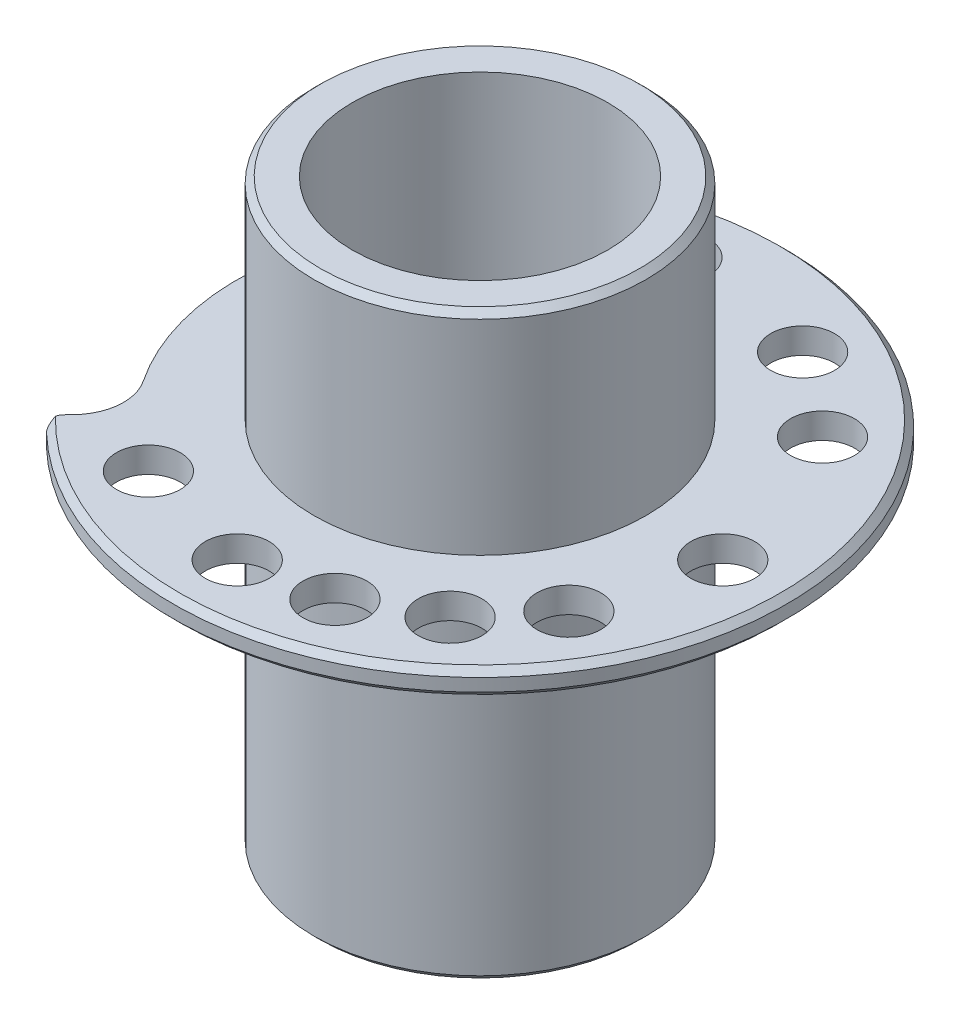
ISO-10303-21;
HEADER;
FILE_DESCRIPTION(('STEP AP214'),'2;1');
FILE_NAME('part.step','',(''),(''),'','','');
FILE_SCHEMA(('AUTOMOTIVE_DESIGN { 1 0 10303 214 1 1 1 1 }'));
ENDSEC;
DATA;
#1=APPLICATION_CONTEXT('core data for automotive mechanical design processes');
#2=APPLICATION_PROTOCOL_DEFINITION('international standard','automotive_design',2000,#1);
#3=PRODUCT_CONTEXT('',#1,'mechanical');
#4=PRODUCT('Part','Part','',(#3));
#5=PRODUCT_RELATED_PRODUCT_CATEGORY('part','',(#4));
#6=PRODUCT_DEFINITION_FORMATION('','',#4);
#7=PRODUCT_DEFINITION_CONTEXT('part definition',#1,'design');
#8=PRODUCT_DEFINITION('design','',#6,#7);
#9=PRODUCT_DEFINITION_SHAPE('','',#8);
#10=(LENGTH_UNIT() NAMED_UNIT(*) SI_UNIT(.MILLI.,.METRE.));
#11=(NAMED_UNIT(*) PLANE_ANGLE_UNIT() SI_UNIT($,.RADIAN.));
#12=(NAMED_UNIT(*) SI_UNIT($,.STERADIAN.) SOLID_ANGLE_UNIT());
#13=UNCERTAINTY_MEASURE_WITH_UNIT(LENGTH_MEASURE(1.E-05),#10,'distance_accuracy_value','');
#14=(GEOMETRIC_REPRESENTATION_CONTEXT(3) GLOBAL_UNCERTAINTY_ASSIGNED_CONTEXT((#13)) GLOBAL_UNIT_ASSIGNED_CONTEXT((#10,
#11,#12)) REPRESENTATION_CONTEXT('',''));
#15=CARTESIAN_POINT('',(0.,0.,0.));
#16=DIRECTION('',(0.,0.,1.));
#17=DIRECTION('',(1.,0.,0.));
#18=AXIS2_PLACEMENT_3D('',#15,#16,#17);
#19=CARTESIAN_POINT('',(0.,1.,0.));
#20=DIRECTION('',(0.,-1.,0.));
#21=DIRECTION('',(0.,0.,-1.));
#22=AXIS2_PLACEMENT_3D('',#19,#20,#21);
#23=CYLINDRICAL_SURFACE('',#22,10.);
#24=CARTESIAN_POINT('',(0.,-28.,0.));
#25=DIRECTION('',(0.,-1.,0.));
#26=DIRECTION('',(0.,0.,1.));
#27=AXIS2_PLACEMENT_3D('',#24,#25,#26);
#28=CIRCLE('',#27,10.);
#29=CARTESIAN_POINT('',(0.,-28.,-10.));
#30=VERTEX_POINT('',#29);
#31=EDGE_CURVE('E274',#30,#30,#28,.T.);
#32=CARTESIAN_POINT('',(0.,17.5,0.));
#33=DIRECTION('',(0.,-1.,0.));
#34=DIRECTION('',(0.,0.,1.));
#35=AXIS2_PLACEMENT_3D('',#32,#33,#34);
#36=CIRCLE('',#35,10.);
#37=CARTESIAN_POINT('',(0.,17.5,-10.));
#38=VERTEX_POINT('',#37);
#39=EDGE_CURVE('E269',#38,#38,#36,.T.);
#40=CARTESIAN_POINT('',(0.,-28.,-10.));
#41=CARTESIAN_POINT('',(0.,-27.5260416666667,-10.));
#42=CARTESIAN_POINT('',(0.,-27.0520833333333,-10.));
#43=CARTESIAN_POINT('',(0.,-26.1041666666667,-10.));
#44=CARTESIAN_POINT('',(0.,-25.6302083333333,-10.));
#45=CARTESIAN_POINT('',(0.,-24.6822916666667,-10.));
#46=CARTESIAN_POINT('',(0.,-24.2083333333333,-10.));
#47=CARTESIAN_POINT('',(0.,-23.2604166666667,-10.));
#48=CARTESIAN_POINT('',(0.,-22.7864583333333,-10.));
#49=CARTESIAN_POINT('',(0.,-21.8385416666667,-10.));
#50=CARTESIAN_POINT('',(0.,-21.3645833333333,-10.));
#51=CARTESIAN_POINT('',(0.,-20.4166666666667,-10.));
#52=CARTESIAN_POINT('',(0.,-19.9427083333333,-10.));
#53=CARTESIAN_POINT('',(0.,-18.9947916666667,-10.));
#54=CARTESIAN_POINT('',(0.,-18.5208333333333,-10.));
#55=CARTESIAN_POINT('',(0.,-17.5729166666667,-10.));
#56=CARTESIAN_POINT('',(0.,-17.0989583333333,-10.));
#57=CARTESIAN_POINT('',(0.,-16.1510416666667,-10.));
#58=CARTESIAN_POINT('',(0.,-15.6770833333333,-10.));
#59=CARTESIAN_POINT('',(0.,-14.7291666666667,-10.));
#60=CARTESIAN_POINT('',(0.,-14.2552083333333,-10.));
#61=CARTESIAN_POINT('',(0.,-13.3072916666667,-10.));
#62=CARTESIAN_POINT('',(0.,-12.8333333333333,-10.));
#63=CARTESIAN_POINT('',(0.,-11.8854166666667,-10.));
#64=CARTESIAN_POINT('',(0.,-11.4114583333333,-10.));
#65=CARTESIAN_POINT('',(0.,-10.4635416666667,-10.));
#66=CARTESIAN_POINT('',(0.,-9.98958333333333,-10.));
#67=CARTESIAN_POINT('',(0.,-9.04166666666666,-10.));
#68=CARTESIAN_POINT('',(0.,-8.56770833333333,-10.));
#69=CARTESIAN_POINT('',(0.,-7.61979166666666,-10.));
#70=CARTESIAN_POINT('',(0.,-7.14583333333333,-10.));
#71=CARTESIAN_POINT('',(0.,-6.19791666666666,-10.));
#72=CARTESIAN_POINT('',(0.,-5.72395833333333,-10.));
#73=CARTESIAN_POINT('',(0.,-4.77604166666666,-10.));
#74=CARTESIAN_POINT('',(0.,-4.30208333333333,-10.));
#75=CARTESIAN_POINT('',(0.,-3.35416666666666,-10.));
#76=CARTESIAN_POINT('',(0.,-2.88020833333333,-10.));
#77=CARTESIAN_POINT('',(0.,-1.93229166666666,-10.));
#78=CARTESIAN_POINT('',(0.,-1.45833333333333,-10.));
#79=CARTESIAN_POINT('',(0.,-0.510416666666662,-10.));
#80=CARTESIAN_POINT('',(0.,-0.036458333333329,-10.));
#81=CARTESIAN_POINT('',(0.,0.911458333333337,-10.));
#82=CARTESIAN_POINT('',(0.,1.38541666666667,-10.));
#83=CARTESIAN_POINT('',(0.,2.33333333333334,-10.));
#84=CARTESIAN_POINT('',(0.,2.80729166666667,-10.));
#85=CARTESIAN_POINT('',(0.,3.75520833333334,-10.));
#86=CARTESIAN_POINT('',(0.,4.22916666666667,-10.));
#87=CARTESIAN_POINT('',(0.,5.17708333333334,-10.));
#88=CARTESIAN_POINT('',(0.,5.65104166666667,-10.));
#89=CARTESIAN_POINT('',(0.,6.59895833333334,-10.));
#90=CARTESIAN_POINT('',(0.,7.07291666666667,-10.));
#91=CARTESIAN_POINT('',(0.,8.02083333333334,-10.));
#92=CARTESIAN_POINT('',(0.,8.49479166666667,-10.));
#93=CARTESIAN_POINT('',(0.,9.44270833333334,-10.));
#94=CARTESIAN_POINT('',(0.,9.91666666666667,-10.));
#95=CARTESIAN_POINT('',(0.,10.8645833333333,-10.));
#96=CARTESIAN_POINT('',(0.,11.3385416666667,-10.));
#97=CARTESIAN_POINT('',(0.,12.2864583333333,-10.));
#98=CARTESIAN_POINT('',(0.,12.7604166666667,-10.));
#99=CARTESIAN_POINT('',(0.,13.7083333333333,-10.));
#100=CARTESIAN_POINT('',(0.,14.1822916666667,-10.));
#101=CARTESIAN_POINT('',(0.,15.1302083333333,-10.));
#102=CARTESIAN_POINT('',(0.,15.6041666666667,-10.));
#103=CARTESIAN_POINT('',(0.,16.5520833333333,-10.));
#104=CARTESIAN_POINT('',(0.,17.0260416666667,-10.));
#105=CARTESIAN_POINT('',(0.,17.5,-10.));
#106=B_SPLINE_CURVE_WITH_KNOTS('',3,(#40,#41,#42,#43,#44,#45,#46,#47,#48,#49,#50,#51,#52,#53,
#54,#55,#56,#57,#58,#59,#60,#61,#62,#63,#64,#65,#66,#67,#68,#69,#70,#71,#72,#73,#74,#75,#76,#77,
#78,#79,#80,#81,#82,#83,#84,#85,#86,#87,#88,#89,#90,#91,#92,#93,#94,#95,#96,#97,#98,#99,#100,
#101,#102,#103,#104,#105),.UNSPECIFIED.,.F.,.F.,(4,2,2,2,2,2,2,2,2,2,2,2,2,2,2,2,2,2,2,2,2,2,2,
2,2,2,2,2,2,2,2,2,4),(0.,1.421875,2.84375,4.265625,5.6875,7.109375,8.53125,9.953125,11.375,
12.796875,14.21875,15.640625,17.0625,18.484375,19.90625,21.328125,22.75,24.171875,25.59375,
27.015625,28.4375,29.859375,31.28125,32.703125,34.125,35.546875,36.96875,38.390625,39.8125,
41.234375,42.65625,44.078125,45.5),.UNSPECIFIED.);
#107=EDGE_CURVE('BSEAM37',#30,#38,#106,.T.);
#108=ORIENTED_EDGE('',*,*,#31,.T.);
#109=ORIENTED_EDGE('',*,*,#39,.F.);
#110=ORIENTED_EDGE('',*,*,#107,.T.);
#111=ORIENTED_EDGE('',*,*,#107,.F.);
#112=EDGE_LOOP('',(#108,#110,#109,#111));
#113=FACE_BOUND('',#112,.T.);
#114=ADVANCED_FACE('F37',(#113),#23,.F.);
#115=CARTESIAN_POINT('',(0.,1.,0.));
#116=DIRECTION('',(0.,-1.,0.));
#117=DIRECTION('',(0.,0.,-1.));
#118=AXIS2_PLACEMENT_3D('',#115,#116,#117);
#119=CYLINDRICAL_SURFACE('',#118,24.);
#120=CARTESIAN_POINT('',(0.,0.499999999999986,0.));
#121=DIRECTION('',(0.,-1.,0.));
#122=DIRECTION('',(0.,0.,1.));
#123=AXIS2_PLACEMENT_3D('',#120,#121,#122);
#124=CIRCLE('',#123,24.);
#125=CARTESIAN_POINT('',(-16.5812485743377,0.499999999999986,17.3511439310503));
#126=VERTEX_POINT('',#125);
#127=CARTESIAN_POINT('',(-9.64683619455973,0.499999999999986,-21.9758629281158));
#128=VERTEX_POINT('',#127);
#129=EDGE_CURVE('E287',#126,#128,#124,.F.);
#130=ORIENTED_EDGE('',*,*,#129,.F.);
#131=DIRECTION('',(0.,-1.,0.));
#132=VECTOR('',#131,1.);
#133=CARTESIAN_POINT('',(-16.5812485743377,1.,17.3511439310503));
#134=LINE('',#133,#132);
#135=CARTESIAN_POINT('',(-16.5812485743377,-0.499999999999993,17.3511439310503));
#136=VERTEX_POINT('',#135);
#137=EDGE_CURVE('E329',#136,#126,#134,.F.);
#138=ORIENTED_EDGE('',*,*,#137,.F.);
#139=CARTESIAN_POINT('',(0.,-0.499999999999993,0.));
#140=DIRECTION('',(0.,-1.,0.));
#141=DIRECTION('',(0.,0.,1.));
#142=AXIS2_PLACEMENT_3D('',#139,#140,#141);
#143=CIRCLE('',#142,24.);
#144=CARTESIAN_POINT('',(-9.64683619455973,-0.499999999999993,-21.9758629281158));
#145=VERTEX_POINT('',#144);
#146=EDGE_CURVE('E273',#145,#136,#143,.T.);
#147=ORIENTED_EDGE('',*,*,#146,.F.);
#148=DIRECTION('',(0.,-1.,0.));
#149=VECTOR('',#148,1.);
#150=CARTESIAN_POINT('',(-9.64683619455973,1.,-21.9758629281158));
#151=LINE('',#150,#149);
#152=EDGE_CURVE('E332',#128,#145,#151,.T.);
#153=ORIENTED_EDGE('',*,*,#152,.F.);
#154=EDGE_LOOP('',(#130,#138,#147,#153));
#155=FACE_BOUND('',#154,.T.);
#156=ADVANCED_FACE('F336',(#155),#119,.T.);
#157=CARTESIAN_POINT('',(0.,1.,0.));
#158=DIRECTION('',(0.,1.,0.));
#159=DIRECTION('',(0.,0.,1.));
#160=AXIS2_PLACEMENT_3D('',#157,#158,#159);
#161=PLANE('',#160);
#162=DIRECTION('',(0.401951508106656,0.,0.915660955338156));
#163=VECTOR('',#162,1.);
#164=CARTESIAN_POINT('',(-8.54215460267814,1.,-16.9714935920191));
#165=LINE('',#164,#163);
#166=CARTESIAN_POINT('',(-10.1605456417912,1.,-20.6582504646709));
#167=VERTEX_POINT('',#166);
#168=CARTESIAN_POINT('',(-9.93944993193131,1.,-20.1545859558223));
#169=VERTEX_POINT('',#168);
#170=EDGE_CURVE('E339',#167,#169,#165,.T.);
#171=ORIENTED_EDGE('',*,*,#170,.T.);
#172=CARTESIAN_POINT('',(-13.6020937532839,1.,-18.5467799233957));
#173=DIRECTION('',(0.,-1.,0.));
#174=DIRECTION('',(0.,0.,1.));
#175=AXIS2_PLACEMENT_3D('',#172,#173,#174);
#176=CIRCLE('',#175,4.);
#177=CARTESIAN_POINT('',(-11.2365122309737,1.,-15.3212529801965));
#178=VERTEX_POINT('',#177);
#179=EDGE_CURVE('E143',#178,#169,#176,.F.);
#180=ORIENTED_EDGE('',*,*,#179,.F.);
#181=CARTESIAN_POINT('',(0.,1.,0.));
#182=DIRECTION('',(0.,1.,0.));
#183=DIRECTION('',(0.,0.,1.));
#184=AXIS2_PLACEMENT_3D('',#181,#182,#183);
#185=CIRCLE('',#184,19.);
#186=CARTESIAN_POINT('',(-15.7990447670323,1.,10.5541548429664));
#187=VERTEX_POINT('',#186);
#188=EDGE_CURVE('E134',#178,#187,#185,.T.);
#189=ORIENTED_EDGE('',*,*,#188,.T.);
#190=CARTESIAN_POINT('',(-19.1251594548285,1.,12.7760821783277));
#191=DIRECTION('',(0.,-1.,0.));
#192=DIRECTION('',(0.,0.,1.));
#193=AXIS2_PLACEMENT_3D('',#190,#191,#192);
#194=CIRCLE('',#193,4.);
#195=CARTESIAN_POINT('',(-16.2333021329868,1.,15.539623607384));
#196=VERTEX_POINT('',#195);
#197=EDGE_CURVE('E119',#196,#187,#194,.F.);
#198=ORIENTED_EDGE('',*,*,#197,.F.);
#199=DIRECTION('',(-0.690885357264071,0.,0.722964330460429));
#200=VECTOR('',#199,1.);
#201=CARTESIAN_POINT('',(-13.8315923165422,1.,13.0263983506176));
#202=LINE('',#201,#200);
#203=CARTESIAN_POINT('',(-16.6133275475341,1.,15.9372942433258));
#204=VERTEX_POINT('',#203);
#205=EDGE_CURVE('E129',#196,#204,#202,.T.);
#206=ORIENTED_EDGE('',*,*,#205,.T.);
#207=CARTESIAN_POINT('',(-15.8903632170736,1.,16.6281796005899));
#208=DIRECTION('',(0.,-1.,0.));
#209=DIRECTION('',(0.,0.,1.));
#210=AXIS2_PLACEMENT_3D('',#207,#208,#209);
#211=CIRCLE('',#210,1.);
#212=CARTESIAN_POINT('',(-16.8573060594065,1.,16.373186385658));
#213=VERTEX_POINT('',#212);
#214=EDGE_CURVE('E156',#213,#204,#211,.T.);
#215=ORIENTED_EDGE('',*,*,#214,.F.);
#216=CARTESIAN_POINT('',(0.,1.,0.));
#217=DIRECTION('',(0.,-1.,0.));
#218=DIRECTION('',(0.,0.,1.));
#219=AXIS2_PLACEMENT_3D('',#216,#217,#218);
#220=CIRCLE('',#219,23.5);
#221=CARTESIAN_POINT('',(-10.2407265560331,1.,-21.1513006598781));
#222=VERTEX_POINT('',#221);
#223=EDGE_CURVE('E284',#222,#213,#220,.T.);
#224=ORIENTED_EDGE('',*,*,#223,.F.);
#225=CARTESIAN_POINT('',(-9.24488468645307,1.,-21.0602019727776));
#226=DIRECTION('',(0.,-1.,0.));
#227=DIRECTION('',(0.,0.,1.));
#228=AXIS2_PLACEMENT_3D('',#225,#226,#227);
#229=CIRCLE('',#228,1.);
#230=EDGE_CURVE('E158',#167,#222,#229,.T.);
#231=ORIENTED_EDGE('',*,*,#230,.F.);
#232=EDGE_LOOP('',(#171,#180,#189,#198,#206,#215,#224,#231));
#233=FACE_BOUND('',#232,.T.);
#234=CARTESIAN_POINT('',(19.,1.,0.));
#235=DIRECTION('',(0.,-1.,0.));
#236=DIRECTION('',(0.,0.,1.));
#237=AXIS2_PLACEMENT_3D('',#234,#235,#236);
#238=CIRCLE('',#237,2.5);
#239=CARTESIAN_POINT('',(19.,1.,2.5));
#240=VERTEX_POINT('',#239);
#241=EDGE_CURVE('E266',#240,#240,#238,.T.);
#242=ORIENTED_EDGE('',*,*,#241,.T.);
#243=EDGE_LOOP('',(#242));
#244=FACE_BOUND('',#243,.T.);
#245=CARTESIAN_POINT('',(-9.50000000000002,1.,16.4544826719043));
#246=DIRECTION('',(0.,-1.,0.));
#247=DIRECTION('',(0.,0.,1.));
#248=AXIS2_PLACEMENT_3D('',#245,#246,#247);
#249=CIRCLE('',#248,2.5);
#250=CARTESIAN_POINT('',(-9.50000000000002,1.,18.9544826719043));
#251=VERTEX_POINT('',#250);
#252=EDGE_CURVE('E262',#251,#251,#249,.T.);
#253=ORIENTED_EDGE('',*,*,#252,.T.);
#254=EDGE_LOOP('',(#253));
#255=FACE_BOUND('',#254,.T.);
#256=CARTESIAN_POINT('',(6.49793606735281,1.,17.8529326181116));
#257=DIRECTION('',(0.,-1.,0.));
#258=DIRECTION('',(0.,0.,1.));
#259=AXIS2_PLACEMENT_3D('',#256,#257,#258);
#260=CIRCLE('',#259,2.5);
#261=CARTESIAN_POINT('',(6.49793606735281,1.,20.3529326181116));
#262=VERTEX_POINT('',#261);
#263=EDGE_CURVE('E258',#262,#262,#260,.T.);
#264=ORIENTED_EDGE('',*,*,#263,.T.);
#265=EDGE_LOOP('',(#264));
#266=FACE_BOUND('',#265,.T.);
#267=CARTESIAN_POINT('',(-3.29931537567156,1.,-18.711347307232));
#268=DIRECTION('',(0.,-1.,0.));
#269=DIRECTION('',(0.,0.,1.));
#270=AXIS2_PLACEMENT_3D('',#267,#268,#269);
#271=CIRCLE('',#270,2.5);
#272=CARTESIAN_POINT('',(-3.29931537567156,1.,-16.211347307232));
#273=VERTEX_POINT('',#272);
#274=EDGE_CURVE('E254',#273,#273,#271,.T.);
#275=ORIENTED_EDGE('',*,*,#274,.T.);
#276=EDGE_LOOP('',(#275));
#277=FACE_BOUND('',#276,.T.);
#278=CARTESIAN_POINT('',(16.4544826719044,1.,9.49999999999996));
#279=DIRECTION('',(0.,-1.,0.));
#280=DIRECTION('',(0.,0.,1.));
#281=AXIS2_PLACEMENT_3D('',#278,#279,#280);
#282=CIRCLE('',#281,2.5);
#283=CARTESIAN_POINT('',(16.4544826719044,1.,12.));
#284=VERTEX_POINT('',#283);
#285=EDGE_CURVE('E250',#284,#284,#282,.T.);
#286=ORIENTED_EDGE('',*,*,#285,.T.);
#287=EDGE_LOOP('',(#286));
#288=FACE_BOUND('',#287,.T.);
#289=CARTESIAN_POINT('',(14.5754053366783,1.,-12.2302172422662));
#290=DIRECTION('',(0.,-1.,0.));
#291=DIRECTION('',(0.,0.,1.));
#292=AXIS2_PLACEMENT_3D('',#289,#290,#291);
#293=CIRCLE('',#292,2.5);
#294=CARTESIAN_POINT('',(14.5754053366783,1.,-9.73021724226621));
#295=VERTEX_POINT('',#294);
#296=EDGE_CURVE('E246',#295,#295,#293,.T.);
#297=ORIENTED_EDGE('',*,*,#296,.T.);
#298=EDGE_LOOP('',(#297));
#299=FACE_BOUND('',#298,.T.);
#300=CARTESIAN_POINT('',(12.2129645840443,1.,14.5548444192606));
#301=DIRECTION('',(0.,-1.,0.));
#302=DIRECTION('',(0.,0.,1.));
#303=AXIS2_PLACEMENT_3D('',#300,#301,#302);
#304=CIRCLE('',#303,2.5);
#305=CARTESIAN_POINT('',(12.2129645840443,1.,17.0548444192606));
#306=VERTEX_POINT('',#305);
#307=EDGE_CURVE('E242',#306,#306,#304,.T.);
#308=ORIENTED_EDGE('',*,*,#307,.T.);
#309=EDGE_LOOP('',(#308));
#310=FACE_BOUND('',#309,.T.);
#311=CARTESIAN_POINT('',(8.02974697307318,1.,-17.2198479536964));
#312=DIRECTION('',(0.,-1.,0.));
#313=DIRECTION('',(0.,0.,1.));
#314=AXIS2_PLACEMENT_3D('',#311,#312,#313);
#315=CIRCLE('',#314,2.5);
#316=CARTESIAN_POINT('',(8.02974697307318,1.,-14.7198479536964));
#317=VERTEX_POINT('',#316);
#318=EDGE_CURVE('E238',#317,#317,#315,.T.);
#319=ORIENTED_EDGE('',*,*,#318,.T.);
#320=EDGE_LOOP('',(#319));
#321=FACE_BOUND('',#320,.T.);
#322=CARTESIAN_POINT('',(0.,1.,19.));
#323=DIRECTION('',(0.,-1.,0.));
#324=DIRECTION('',(0.,0.,1.));
#325=AXIS2_PLACEMENT_3D('',#322,#323,#324);
#326=CIRCLE('',#325,2.5);
#327=CARTESIAN_POINT('',(0.,1.,21.5));
#328=VERTEX_POINT('',#327);
#329=EDGE_CURVE('E234',#328,#328,#326,.T.);
#330=ORIENTED_EDGE('',*,*,#329,.T.);
#331=EDGE_LOOP('',(#330));
#332=FACE_BOUND('',#331,.T.);
#333=CARTESIAN_POINT('',(0.,1.,0.));
#334=DIRECTION('',(0.,-1.,0.));
#335=DIRECTION('',(0.,0.,1.));
#336=AXIS2_PLACEMENT_3D('',#333,#334,#335);
#337=CIRCLE('',#336,13.);
#338=CARTESIAN_POINT('',(0.,1.,13.));
#339=VERTEX_POINT('',#338);
#340=EDGE_CURVE('E277',#339,#339,#337,.F.);
#341=ORIENTED_EDGE('',*,*,#340,.F.);
#342=EDGE_LOOP('',(#341));
#343=FACE_BOUND('',#342,.T.);
#344=ADVANCED_FACE('F137',(#233,#244,#255,#266,#277,#288,#299,#310,#321,#332,#343),#161,.T.);
#345=CARTESIAN_POINT('',(0.,-1.,0.));
#346=DIRECTION('',(0.,1.,0.));
#347=DIRECTION('',(0.,0.,1.));
#348=AXIS2_PLACEMENT_3D('',#345,#346,#347);
#349=PLANE('',#348);
#350=CARTESIAN_POINT('',(19.,-1.,0.));
#351=DIRECTION('',(0.,-1.,0.));
#352=DIRECTION('',(0.,0.,1.));
#353=AXIS2_PLACEMENT_3D('',#350,#351,#352);
#354=CIRCLE('',#353,2.5);
#355=CARTESIAN_POINT('',(19.,-1.,2.5));
#356=VERTEX_POINT('',#355);
#357=EDGE_CURVE('E265',#356,#356,#354,.T.);
#358=ORIENTED_EDGE('',*,*,#357,.F.);
#359=EDGE_LOOP('',(#358));
#360=FACE_BOUND('',#359,.T.);
#361=CARTESIAN_POINT('',(-9.50000000000002,-1.,16.4544826719043));
#362=DIRECTION('',(0.,-1.,0.));
#363=DIRECTION('',(0.,0.,1.));
#364=AXIS2_PLACEMENT_3D('',#361,#362,#363);
#365=CIRCLE('',#364,2.5);
#366=CARTESIAN_POINT('',(-9.50000000000002,-1.,18.9544826719043));
#367=VERTEX_POINT('',#366);
#368=EDGE_CURVE('E261',#367,#367,#365,.T.);
#369=ORIENTED_EDGE('',*,*,#368,.F.);
#370=EDGE_LOOP('',(#369));
#371=FACE_BOUND('',#370,.T.);
#372=CARTESIAN_POINT('',(6.49793606735281,-1.,17.8529326181116));
#373=DIRECTION('',(0.,-1.,0.));
#374=DIRECTION('',(0.,0.,1.));
#375=AXIS2_PLACEMENT_3D('',#372,#373,#374);
#376=CIRCLE('',#375,2.5);
#377=CARTESIAN_POINT('',(6.49793606735281,-1.,20.3529326181116));
#378=VERTEX_POINT('',#377);
#379=EDGE_CURVE('E257',#378,#378,#376,.T.);
#380=ORIENTED_EDGE('',*,*,#379,.F.);
#381=EDGE_LOOP('',(#380));
#382=FACE_BOUND('',#381,.T.);
#383=CARTESIAN_POINT('',(-3.29931537567156,-1.,-18.711347307232));
#384=DIRECTION('',(0.,-1.,0.));
#385=DIRECTION('',(0.,0.,1.));
#386=AXIS2_PLACEMENT_3D('',#383,#384,#385);
#387=CIRCLE('',#386,2.5);
#388=CARTESIAN_POINT('',(-3.29931537567156,-1.,-16.211347307232));
#389=VERTEX_POINT('',#388);
#390=EDGE_CURVE('E253',#389,#389,#387,.T.);
#391=ORIENTED_EDGE('',*,*,#390,.F.);
#392=EDGE_LOOP('',(#391));
#393=FACE_BOUND('',#392,.T.);
#394=CARTESIAN_POINT('',(16.4544826719044,-1.,9.49999999999996));
#395=DIRECTION('',(0.,-1.,0.));
#396=DIRECTION('',(0.,0.,1.));
#397=AXIS2_PLACEMENT_3D('',#394,#395,#396);
#398=CIRCLE('',#397,2.5);
#399=CARTESIAN_POINT('',(16.4544826719044,-1.,12.));
#400=VERTEX_POINT('',#399);
#401=EDGE_CURVE('E249',#400,#400,#398,.T.);
#402=ORIENTED_EDGE('',*,*,#401,.F.);
#403=EDGE_LOOP('',(#402));
#404=FACE_BOUND('',#403,.T.);
#405=CARTESIAN_POINT('',(14.5754053366783,-1.,-12.2302172422662));
#406=DIRECTION('',(0.,-1.,0.));
#407=DIRECTION('',(0.,0.,1.));
#408=AXIS2_PLACEMENT_3D('',#405,#406,#407);
#409=CIRCLE('',#408,2.5);
#410=CARTESIAN_POINT('',(14.5754053366783,-1.,-9.73021724226621));
#411=VERTEX_POINT('',#410);
#412=EDGE_CURVE('E245',#411,#411,#409,.T.);
#413=ORIENTED_EDGE('',*,*,#412,.F.);
#414=EDGE_LOOP('',(#413));
#415=FACE_BOUND('',#414,.T.);
#416=CARTESIAN_POINT('',(12.2129645840443,-1.,14.5548444192606));
#417=DIRECTION('',(0.,-1.,0.));
#418=DIRECTION('',(0.,0.,1.));
#419=AXIS2_PLACEMENT_3D('',#416,#417,#418);
#420=CIRCLE('',#419,2.5);
#421=CARTESIAN_POINT('',(12.2129645840443,-1.,17.0548444192606));
#422=VERTEX_POINT('',#421);
#423=EDGE_CURVE('E241',#422,#422,#420,.T.);
#424=ORIENTED_EDGE('',*,*,#423,.F.);
#425=EDGE_LOOP('',(#424));
#426=FACE_BOUND('',#425,.T.);
#427=CARTESIAN_POINT('',(8.02974697307318,-1.,-17.2198479536964));
#428=DIRECTION('',(0.,-1.,0.));
#429=DIRECTION('',(0.,0.,1.));
#430=AXIS2_PLACEMENT_3D('',#427,#428,#429);
#431=CIRCLE('',#430,2.5);
#432=CARTESIAN_POINT('',(8.02974697307318,-1.,-14.7198479536964));
#433=VERTEX_POINT('',#432);
#434=EDGE_CURVE('E237',#433,#433,#431,.T.);
#435=ORIENTED_EDGE('',*,*,#434,.F.);
#436=EDGE_LOOP('',(#435));
#437=FACE_BOUND('',#436,.T.);
#438=CARTESIAN_POINT('',(0.,-1.,19.));
#439=DIRECTION('',(0.,-1.,0.));
#440=DIRECTION('',(0.,0.,1.));
#441=AXIS2_PLACEMENT_3D('',#438,#439,#440);
#442=CIRCLE('',#441,2.5);
#443=CARTESIAN_POINT('',(0.,-1.,21.5));
#444=VERTEX_POINT('',#443);
#445=EDGE_CURVE('E230',#444,#444,#442,.T.);
#446=ORIENTED_EDGE('',*,*,#445,.F.);
#447=EDGE_LOOP('',(#446));
#448=FACE_BOUND('',#447,.T.);
#449=CARTESIAN_POINT('',(0.,-1.,0.));
#450=DIRECTION('',(0.,-1.,0.));
#451=DIRECTION('',(0.,0.,1.));
#452=AXIS2_PLACEMENT_3D('',#449,#450,#451);
#453=CIRCLE('',#452,23.5);
#454=CARTESIAN_POINT('',(-16.8573060594065,-1.,16.373186385658));
#455=VERTEX_POINT('',#454);
#456=CARTESIAN_POINT('',(-10.240726556033,-1.,-21.1513006598781));
#457=VERTEX_POINT('',#456);
#458=EDGE_CURVE('E282',#455,#457,#453,.F.);
#459=ORIENTED_EDGE('',*,*,#458,.F.);
#460=CARTESIAN_POINT('',(-15.8903632170736,-1.,16.6281796005899));
#461=DIRECTION('',(0.,-1.,0.));
#462=DIRECTION('',(0.,0.,1.));
#463=AXIS2_PLACEMENT_3D('',#460,#461,#462);
#464=CIRCLE('',#463,1.);
#465=CARTESIAN_POINT('',(-16.6133275475341,-1.,15.9372942433258));
#466=VERTEX_POINT('',#465);
#467=EDGE_CURVE('E210',#466,#455,#464,.F.);
#468=ORIENTED_EDGE('',*,*,#467,.F.);
#469=DIRECTION('',(-0.690885357264071,0.,0.722964330460429));
#470=VECTOR('',#469,1.);
#471=CARTESIAN_POINT('',(-0.722964330460431,-1.,-0.690885357264073));
#472=LINE('',#471,#470);
#473=CARTESIAN_POINT('',(-16.2333021329868,-1.,15.539623607384));
#474=VERTEX_POINT('',#473);
#475=EDGE_CURVE('E228',#474,#466,#472,.T.);
#476=ORIENTED_EDGE('',*,*,#475,.F.);
#477=CARTESIAN_POINT('',(-19.1251594548285,-1.,12.7760821783277));
#478=DIRECTION('',(0.,-1.,0.));
#479=DIRECTION('',(0.,0.,1.));
#480=AXIS2_PLACEMENT_3D('',#477,#478,#479);
#481=CIRCLE('',#480,4.);
#482=CARTESIAN_POINT('',(-15.7990447670323,-1.,10.5541548429664));
#483=VERTEX_POINT('',#482);
#484=EDGE_CURVE('E122',#483,#474,#481,.T.);
#485=ORIENTED_EDGE('',*,*,#484,.F.);
#486=CARTESIAN_POINT('',(0.,-1.,0.));
#487=DIRECTION('',(0.,-1.,0.));
#488=DIRECTION('',(0.,0.,1.));
#489=AXIS2_PLACEMENT_3D('',#486,#487,#488);
#490=CIRCLE('',#489,19.);
#491=CARTESIAN_POINT('',(-11.2365122309737,-1.,-15.3212529801965));
#492=VERTEX_POINT('',#491);
#493=EDGE_CURVE('E126',#492,#483,#490,.F.);
#494=ORIENTED_EDGE('',*,*,#493,.F.);
#495=CARTESIAN_POINT('',(-13.6020937532839,-1.,-18.5467799233957));
#496=DIRECTION('',(0.,-1.,0.));
#497=DIRECTION('',(0.,0.,1.));
#498=AXIS2_PLACEMENT_3D('',#495,#496,#497);
#499=CIRCLE('',#498,4.);
#500=CARTESIAN_POINT('',(-9.93944993193131,-1.,-20.1545859558223));
#501=VERTEX_POINT('',#500);
#502=EDGE_CURVE('E151',#501,#492,#499,.T.);
#503=ORIENTED_EDGE('',*,*,#502,.F.);
#504=DIRECTION('',(0.401951508106656,0.,0.915660955338156));
#505=VECTOR('',#504,1.);
#506=CARTESIAN_POINT('',(-0.915660955338128,-1.,0.401951508106644));
#507=LINE('',#506,#505);
#508=CARTESIAN_POINT('',(-10.1605456417912,-1.,-20.6582504646709));
#509=VERTEX_POINT('',#508);
#510=EDGE_CURVE('E133',#509,#501,#507,.T.);
#511=ORIENTED_EDGE('',*,*,#510,.F.);
#512=CARTESIAN_POINT('',(-9.24488468645307,-1.,-21.0602019727776));
#513=DIRECTION('',(0.,-1.,0.));
#514=DIRECTION('',(0.,0.,1.));
#515=AXIS2_PLACEMENT_3D('',#512,#513,#514);
#516=CIRCLE('',#515,1.);
#517=EDGE_CURVE('E46',#457,#509,#516,.F.);
#518=ORIENTED_EDGE('',*,*,#517,.F.);
#519=EDGE_LOOP('',(#459,#468,#476,#485,#494,#503,#511,#518));
#520=FACE_BOUND('',#519,.T.);
#521=CARTESIAN_POINT('',(0.,-1.,0.));
#522=DIRECTION('',(0.,-1.,0.));
#523=DIRECTION('',(0.,0.,1.));
#524=AXIS2_PLACEMENT_3D('',#521,#522,#523);
#525=CIRCLE('',#524,13.);
#526=CARTESIAN_POINT('',(0.,-1.,13.));
#527=VERTEX_POINT('',#526);
#528=EDGE_CURVE('E270',#527,#527,#525,.F.);
#529=ORIENTED_EDGE('',*,*,#528,.T.);
#530=EDGE_LOOP('',(#529));
#531=FACE_BOUND('',#530,.T.);
#532=ADVANCED_FACE('F224',(#360,#371,#382,#393,#404,#415,#426,#437,#448,#520,#531),#349,.F.);
#533=CARTESIAN_POINT('',(0.,-28.,0.));
#534=DIRECTION('',(0.,1.,0.));
#535=DIRECTION('',(0.,0.,1.));
#536=AXIS2_PLACEMENT_3D('',#533,#534,#535);
#537=CYLINDRICAL_SURFACE('',#536,13.);
#538=CARTESIAN_POINT('',(0.,-27.5,0.));
#539=DIRECTION('',(0.,-1.,0.));
#540=DIRECTION('',(0.,0.,1.));
#541=AXIS2_PLACEMENT_3D('',#538,#539,#540);
#542=CIRCLE('',#541,13.);
#543=CARTESIAN_POINT('',(0.,-27.5,13.));
#544=VERTEX_POINT('',#543);
#545=EDGE_CURVE('E290',#544,#544,#542,.T.);
#546=ORIENTED_EDGE('',*,*,#545,.F.);
#547=EDGE_LOOP('',(#546));
#548=FACE_BOUND('',#547,.T.);
#549=ORIENTED_EDGE('',*,*,#528,.F.);
#550=EDGE_LOOP('',(#549));
#551=FACE_BOUND('',#550,.T.);
#552=ADVANCED_FACE('F364',(#548,#551),#537,.T.);
#553=CARTESIAN_POINT('',(0.,-28.,0.));
#554=DIRECTION('',(0.,1.,0.));
#555=DIRECTION('',(0.,0.,1.));
#556=AXIS2_PLACEMENT_3D('',#553,#554,#555);
#557=PLANE('',#556);
#558=CARTESIAN_POINT('',(0.,-28.,0.));
#559=DIRECTION('',(0.,-1.,0.));
#560=DIRECTION('',(0.,0.,1.));
#561=AXIS2_PLACEMENT_3D('',#558,#559,#560);
#562=CIRCLE('',#561,12.5);
#563=CARTESIAN_POINT('',(0.,-28.,12.5));
#564=VERTEX_POINT('',#563);
#565=EDGE_CURVE('E293',#564,#564,#562,.F.);
#566=ORIENTED_EDGE('',*,*,#565,.F.);
#567=EDGE_LOOP('',(#566));
#568=FACE_BOUND('',#567,.T.);
#569=ORIENTED_EDGE('',*,*,#31,.F.);
#570=EDGE_LOOP('',(#569));
#571=FACE_BOUND('',#570,.T.);
#572=ADVANCED_FACE('F367',(#568,#571),#557,.F.);
#573=CARTESIAN_POINT('',(0.,17.5,0.));
#574=DIRECTION('',(0.,-1.,0.));
#575=DIRECTION('',(0.,0.,-1.));
#576=AXIS2_PLACEMENT_3D('',#573,#574,#575);
#577=CYLINDRICAL_SURFACE('',#576,13.);
#578=CARTESIAN_POINT('',(0.,17.,0.));
#579=DIRECTION('',(0.,-1.,0.));
#580=DIRECTION('',(0.,0.,1.));
#581=AXIS2_PLACEMENT_3D('',#578,#579,#580);
#582=CIRCLE('',#581,13.);
#583=CARTESIAN_POINT('',(0.,17.,13.));
#584=VERTEX_POINT('',#583);
#585=EDGE_CURVE('E301',#584,#584,#582,.F.);
#586=ORIENTED_EDGE('',*,*,#585,.F.);
#587=EDGE_LOOP('',(#586));
#588=FACE_BOUND('',#587,.T.);
#589=ORIENTED_EDGE('',*,*,#340,.T.);
#590=EDGE_LOOP('',(#589));
#591=FACE_BOUND('',#590,.T.);
#592=ADVANCED_FACE('F359',(#588,#591),#577,.T.);
#593=CARTESIAN_POINT('',(0.,17.5,0.));
#594=DIRECTION('',(0.,1.,0.));
#595=DIRECTION('',(0.,0.,1.));
#596=AXIS2_PLACEMENT_3D('',#593,#594,#595);
#597=PLANE('',#596);
#598=CARTESIAN_POINT('',(0.,17.5,0.));
#599=DIRECTION('',(0.,-1.,0.));
#600=DIRECTION('',(0.,0.,1.));
#601=AXIS2_PLACEMENT_3D('',#598,#599,#600);
#602=CIRCLE('',#601,12.5);
#603=CARTESIAN_POINT('',(0.,17.5,12.5));
#604=VERTEX_POINT('',#603);
#605=EDGE_CURVE('E296',#604,#604,#602,.T.);
#606=ORIENTED_EDGE('',*,*,#605,.F.);
#607=EDGE_LOOP('',(#606));
#608=FACE_BOUND('',#607,.T.);
#609=ORIENTED_EDGE('',*,*,#39,.T.);
#610=EDGE_LOOP('',(#609));
#611=FACE_BOUND('',#610,.T.);
#612=ADVANCED_FACE('F390',(#608,#611),#597,.T.);
#613=CARTESIAN_POINT('',(0.,-0.499999999999993,0.));
#614=DIRECTION('',(0.,1.,0.));
#615=DIRECTION('',(0.,0.,1.));
#616=AXIS2_PLACEMENT_3D('',#613,#614,#615);
#617=CONICAL_SURFACE('',#616,24.,0.785398163397448);
#618=ORIENTED_EDGE('',*,*,#146,.T.);
#619=CARTESIAN_POINT('',(-16.8573060594065,-1.,16.373186385658));
#620=CARTESIAN_POINT('',(-16.8735922975908,-0.945201522056867,16.4350495621519));
#621=CARTESIAN_POINT('',(-16.884497641289,-0.89172513941164,16.5004934413562));
#622=CARTESIAN_POINT('',(-16.8927081206713,-0.790105731591417,16.6372419226301));
#623=CARTESIAN_POINT('',(-16.8898584888547,-0.742029656568498,16.7086042970451));
#624=CARTESIAN_POINT('',(-16.8717527211867,-0.672652336883968,16.8252102554568));
#625=CARTESIAN_POINT('',(-16.8619213448272,-0.648338287076315,16.8694702536931));
#626=CARTESIAN_POINT('',(-16.8354978648298,-0.604190876331415,16.9581059214783));
#627=CARTESIAN_POINT('',(-16.8189256859053,-0.584344575743717,17.0024808704156));
#628=CARTESIAN_POINT('',(-16.7783206270313,-0.550016969222432,17.090691247808));
#629=CARTESIAN_POINT('',(-16.7541976070166,-0.535605386631852,17.1345131222569));
#630=CARTESIAN_POINT('',(-16.6986419857441,-0.513738200910342,17.2191325895594));
#631=CARTESIAN_POINT('',(-16.6672300005286,-0.506263270882027,17.2599382919393));
#632=CARTESIAN_POINT('',(-16.624486783091,-0.501742788643553,17.3073089386718));
#633=CARTESIAN_POINT('',(-16.6160673877921,-0.501089435517572,17.3162977013591));
#634=CARTESIAN_POINT('',(-16.5989014627632,-0.500218845265944,17.3339584451264));
#635=CARTESIAN_POINT('',(-16.5901553316989,-0.50000109327631,17.3426307882795));
#636=CARTESIAN_POINT('',(-16.5812485743377,-0.499999999999995,17.3511439310503));
#637=B_SPLINE_CURVE_WITH_KNOTS('',3,(#619,#620,#621,#622,#623,#624,#625,#626,#627,#628,#629,
#630,#631,#632,#633,#634,#635,#636),.UNSPECIFIED.,.F.,.F.,(4,2,2,2,2,2,2,2,4),(0.,
0.253646710119168,0.510153997792851,0.66394979777317,0.817294268226541,0.972544028023258,
1.12735992077598,1.16435003442974,1.20129640128145),.UNSPECIFIED.);
#638=EDGE_CURVE('E211',#455,#136,#637,.T.);
#639=ORIENTED_EDGE('',*,*,#638,.F.);
#640=ORIENTED_EDGE('',*,*,#458,.T.);
#641=CARTESIAN_POINT('',(-9.64683619455973,-0.499999999999993,-21.9758629281158));
#642=CARTESIAN_POINT('',(-9.66758984804915,-0.499997361037034,-21.9667557469492));
#643=CARTESIAN_POINT('',(-9.68801870677943,-0.50073901557201,-21.9569426830524));
#644=CARTESIAN_POINT('',(-9.72806951515627,-0.503679050760108,-21.9360112311293));
#645=CARTESIAN_POINT('',(-9.74769203051387,-0.505876390946741,-21.9248937800943));
#646=CARTESIAN_POINT('',(-9.80482128402231,-0.514554642289489,-21.8899294312927));
#647=CARTESIAN_POINT('',(-9.84095947165225,-0.523123058893588,-21.864306742837));
#648=CARTESIAN_POINT('',(-9.90852139929597,-0.545204066509054,-21.8095214595563));
#649=CARTESIAN_POINT('',(-9.93995625903215,-0.558704727651295,-21.7803675187447));
#650=CARTESIAN_POINT('',(-9.99795300071954,-0.58988160895553,-21.7194895383163));
#651=CARTESIAN_POINT('',(-10.0245055787625,-0.607565657570444,-21.6877607543763));
#652=CARTESIAN_POINT('',(-10.0819155269648,-0.653741602025029,-21.6102161421117));
#653=CARTESIAN_POINT('',(-10.1105252546683,-0.683778607625031,-21.5636601358511));
#654=CARTESIAN_POINT('',(-10.1589692895946,-0.748589977364394,-21.4692011383698));
#655=CARTESIAN_POINT('',(-10.1787777968114,-0.783377883709377,-21.4212946191054));
#656=CARTESIAN_POINT('',(-10.2069074352445,-0.848256495368915,-21.3359966590808));
#657=CARTESIAN_POINT('',(-10.2167963896843,-0.877699399901134,-21.2986080386712));
#658=CARTESIAN_POINT('',(-10.2320174867299,-0.937917745163764,-21.2244680115807));
#659=CARTESIAN_POINT('',(-10.2373849976941,-0.968680826753673,-21.1877139044758));
#660=CARTESIAN_POINT('',(-10.2407265560331,-1.,-21.1513006598781));
#661=B_SPLINE_CURVE_WITH_KNOTS('',3,(#641,#642,#643,#644,#645,#646,#647,#648,#649,#650,#651,
#652,#653,#654,#655,#656,#657,#658,#659,#660),.UNSPECIFIED.,.F.,.F.,(4,2,2,2,2,2,2,2,2,4),(0.,
0.0679405744702415,0.135832640025221,0.270422297460947,0.404688548355429,0.539208070008987,
0.725260368227983,0.911854521029675,1.05744283770831,1.2018814462198),.UNSPECIFIED.);
#662=EDGE_CURVE('E59',#145,#457,#661,.T.);
#663=ORIENTED_EDGE('',*,*,#662,.F.);
#664=EDGE_LOOP('',(#618,#639,#640,#663));
#665=FACE_BOUND('',#664,.T.);
#666=ADVANCED_FACE('F180',(#665),#617,.T.);
#667=CARTESIAN_POINT('',(0.,1.,0.));
#668=DIRECTION('',(0.,-1.,0.));
#669=DIRECTION('',(0.,0.,-1.));
#670=AXIS2_PLACEMENT_3D('',#667,#668,#669);
#671=CONICAL_SURFACE('',#670,23.5,0.785398163397438);
#672=ORIENTED_EDGE('',*,*,#223,.T.);
#673=CARTESIAN_POINT('',(-16.5812485743377,0.499999999999986,17.3511439310503));
#674=CARTESIAN_POINT('',(-16.5976357899682,0.499997361037026,17.3354878125709));
#675=CARTESIAN_POINT('',(-16.6134763722477,0.500739015572001,17.3192794676489));
#676=CARTESIAN_POINT('',(-16.6439528431491,0.5036790507601,17.2859121535131));
#677=CARTESIAN_POINT('',(-16.6585895838355,0.505876390946733,17.2687538712985));
#678=CARTESIAN_POINT('',(-16.7003150102,0.514554642289483,17.2163587752661));
#679=CARTESIAN_POINT('',(-16.7255103228664,0.523123058893582,17.1799213358868));
#680=CARTESIAN_POINT('',(-16.7702600972795,0.545204066509049,17.1053324692842));
#681=CARTESIAN_POINT('',(-16.7898279679941,0.55870472765129,17.0671853710043));
#682=CARTESIAN_POINT('',(-16.8235055825959,0.589881608955525,16.9901427281231));
#683=CARTESIAN_POINT('',(-16.8376049610151,0.607565657570438,16.9512459074402));
#684=CARTESIAN_POINT('',(-16.8650308462995,0.653741602025023,16.858742448801));
#685=CARTESIAN_POINT('',(-16.8759921043713,0.683778607625026,16.805209010095));
#686=CARTESIAN_POINT('',(-16.8892077266556,0.748589977364391,16.6998777514262));
#687=CARTESIAN_POINT('',(-16.891436640131,0.783377883709374,16.6480854403085));
#688=CARTESIAN_POINT('',(-16.888696233279,0.848256495368914,16.5583106737368));
#689=CARTESIAN_POINT('',(-16.8852011494821,0.877699399901132,16.5197946414217));
#690=CARTESIAN_POINT('',(-16.8741469193645,0.937917745163763,16.4449198832667));
#691=CARTESIAN_POINT('',(-16.8666200848297,0.968680826753672,16.4085465231674));
#692=CARTESIAN_POINT('',(-16.8573060594065,1.,16.373186385658));
#693=B_SPLINE_CURVE_WITH_KNOTS('',3,(#673,#674,#675,#676,#677,#678,#679,#680,#681,#682,#683,
#684,#685,#686,#687,#688,#689,#690,#691,#692),.UNSPECIFIED.,.F.,.F.,(4,2,2,2,2,2,2,2,2,4),(0.,
0.0679405744702413,0.135832640025225,0.270422297460949,0.404688548355431,0.539208070008989,
0.725260368227985,0.91185452102968,1.05744283770831,1.20188144621981),.UNSPECIFIED.);
#694=EDGE_CURVE('E161',#126,#213,#693,.T.);
#695=ORIENTED_EDGE('',*,*,#694,.F.);
#696=ORIENTED_EDGE('',*,*,#129,.T.);
#697=CARTESIAN_POINT('',(-10.2407265560331,1.,-21.1513006598781));
#698=CARTESIAN_POINT('',(-10.2348721613842,0.945201522056869,-21.2150032518458));
#699=CARTESIAN_POINT('',(-10.2227367074392,0.891725139411642,-21.2802302294244));
#700=CARTESIAN_POINT('',(-10.1836812991631,0.790105731591417,-21.4115399175162));
#701=CARTESIAN_POINT('',(-10.1565961516476,0.742029656568497,-21.4776239826734));
#702=CARTESIAN_POINT('',(-10.0997007087677,0.672652336883965,-21.5810052040798));
#703=CARTESIAN_POINT('',(-10.0753244260101,0.648338287076312,-21.6192334690669));
#704=CARTESIAN_POINT('',(-10.0201792930415,0.604190876331412,-21.6934863896072));
#705=CARTESIAN_POINT('',(-9.98942941240017,0.584344575743713,-21.7295171826603));
#706=CARTESIAN_POINT('',(-9.92110341229107,0.55001696922243,-21.7985200753168));
#707=CARTESIAN_POINT('',(-9.88344722461237,0.535605386631851,-21.8314486086026));
#708=CARTESIAN_POINT('',(-9.80230045492452,0.513738200910338,-21.8919637560514));
#709=CARTESIAN_POINT('',(-9.75882647203681,0.50626327088202,-21.9195650417783));
#710=CARTESIAN_POINT('',(-9.70245927063717,0.501742788643547,-21.9494598476004));
#711=CARTESIAN_POINT('',(-9.69147328910063,0.501089435517567,-21.9550269187808));
#712=CARTESIAN_POINT('',(-9.66930226590752,0.500218845265939,-21.9657514972379));
#713=CARTESIAN_POINT('',(-9.65811747503776,0.500001093276305,-21.9709094811036));
#714=CARTESIAN_POINT('',(-9.64683619455973,0.499999999999988,-21.9758629281158));
#715=B_SPLINE_CURVE_WITH_KNOTS('',3,(#697,#698,#699,#700,#701,#702,#703,#704,#705,#706,#707,
#708,#709,#710,#711,#712,#713,#714),.UNSPECIFIED.,.F.,.F.,(4,2,2,2,2,2,2,2,4),(0.,
0.253646710119166,0.51015399779285,0.663949797773166,0.817294268226537,0.97254402802325,
1.12735992077597,1.16435003442974,1.20129640128145),.UNSPECIFIED.);
#716=EDGE_CURVE('E168',#222,#128,#715,.T.);
#717=ORIENTED_EDGE('',*,*,#716,.F.);
#718=EDGE_LOOP('',(#672,#695,#696,#717));
#719=FACE_BOUND('',#718,.T.);
#720=ADVANCED_FACE('F174',(#719),#671,.T.);
#721=CARTESIAN_POINT('',(0.,-27.5,0.));
#722=DIRECTION('',(0.,1.,0.));
#723=DIRECTION('',(0.,0.,1.));
#724=AXIS2_PLACEMENT_3D('',#721,#722,#723);
#725=CONICAL_SURFACE('',#724,13.,0.785398163397453);
#726=ORIENTED_EDGE('',*,*,#565,.T.);
#727=EDGE_LOOP('',(#726));
#728=FACE_BOUND('',#727,.T.);
#729=ORIENTED_EDGE('',*,*,#545,.T.);
#730=EDGE_LOOP('',(#729));
#731=FACE_BOUND('',#730,.T.);
#732=ADVANCED_FACE('F179',(#728,#731),#725,.T.);
#733=CARTESIAN_POINT('',(0.,17.5,0.));
#734=DIRECTION('',(0.,-1.,0.));
#735=DIRECTION('',(0.,0.,-1.));
#736=AXIS2_PLACEMENT_3D('',#733,#734,#735);
#737=CONICAL_SURFACE('',#736,12.5,0.785398163397452);
#738=ORIENTED_EDGE('',*,*,#585,.T.);
#739=EDGE_LOOP('',(#738));
#740=FACE_BOUND('',#739,.T.);
#741=ORIENTED_EDGE('',*,*,#605,.T.);
#742=EDGE_LOOP('',(#741));
#743=FACE_BOUND('',#742,.T.);
#744=ADVANCED_FACE('F187',(#740,#743),#737,.T.);
#745=CARTESIAN_POINT('',(0.,17.5,19.));
#746=DIRECTION('',(0.,-1.,0.));
#747=DIRECTION('',(0.,0.,-1.));
#748=AXIS2_PLACEMENT_3D('',#745,#746,#747);
#749=CYLINDRICAL_SURFACE('',#748,2.5);
#750=ORIENTED_EDGE('',*,*,#329,.F.);
#751=EDGE_LOOP('',(#750));
#752=FACE_BOUND('',#751,.T.);
#753=ORIENTED_EDGE('',*,*,#445,.T.);
#754=EDGE_LOOP('',(#753));
#755=FACE_BOUND('',#754,.T.);
#756=ADVANCED_FACE('F191',(#752,#755),#749,.F.);
#757=CARTESIAN_POINT('',(8.02974697307318,17.5,-17.2198479536964));
#758=DIRECTION('',(0.,-1.,0.));
#759=DIRECTION('',(0.,0.,-1.));
#760=AXIS2_PLACEMENT_3D('',#757,#758,#759);
#761=CYLINDRICAL_SURFACE('',#760,2.5);
#762=ORIENTED_EDGE('',*,*,#318,.F.);
#763=EDGE_LOOP('',(#762));
#764=FACE_BOUND('',#763,.T.);
#765=ORIENTED_EDGE('',*,*,#434,.T.);
#766=EDGE_LOOP('',(#765));
#767=FACE_BOUND('',#766,.T.);
#768=ADVANCED_FACE('F420',(#764,#767),#761,.F.);
#769=CARTESIAN_POINT('',(12.2129645840443,17.5,14.5548444192606));
#770=DIRECTION('',(0.,-1.,0.));
#771=DIRECTION('',(0.,0.,-1.));
#772=AXIS2_PLACEMENT_3D('',#769,#770,#771);
#773=CYLINDRICAL_SURFACE('',#772,2.5);
#774=ORIENTED_EDGE('',*,*,#307,.F.);
#775=EDGE_LOOP('',(#774));
#776=FACE_BOUND('',#775,.T.);
#777=ORIENTED_EDGE('',*,*,#423,.T.);
#778=EDGE_LOOP('',(#777));
#779=FACE_BOUND('',#778,.T.);
#780=ADVANCED_FACE('F428',(#776,#779),#773,.F.);
#781=CARTESIAN_POINT('',(14.5754053366783,17.5,-12.2302172422662));
#782=DIRECTION('',(0.,-1.,0.));
#783=DIRECTION('',(0.,0.,-1.));
#784=AXIS2_PLACEMENT_3D('',#781,#782,#783);
#785=CYLINDRICAL_SURFACE('',#784,2.5);
#786=ORIENTED_EDGE('',*,*,#296,.F.);
#787=EDGE_LOOP('',(#786));
#788=FACE_BOUND('',#787,.T.);
#789=ORIENTED_EDGE('',*,*,#412,.T.);
#790=EDGE_LOOP('',(#789));
#791=FACE_BOUND('',#790,.T.);
#792=ADVANCED_FACE('F436',(#788,#791),#785,.F.);
#793=CARTESIAN_POINT('',(16.4544826719044,17.5,9.49999999999996));
#794=DIRECTION('',(0.,-1.,0.));
#795=DIRECTION('',(0.,0.,-1.));
#796=AXIS2_PLACEMENT_3D('',#793,#794,#795);
#797=CYLINDRICAL_SURFACE('',#796,2.5);
#798=ORIENTED_EDGE('',*,*,#285,.F.);
#799=EDGE_LOOP('',(#798));
#800=FACE_BOUND('',#799,.T.);
#801=ORIENTED_EDGE('',*,*,#401,.T.);
#802=EDGE_LOOP('',(#801));
#803=FACE_BOUND('',#802,.T.);
#804=ADVANCED_FACE('F444',(#800,#803),#797,.F.);
#805=CARTESIAN_POINT('',(-3.29931537567156,17.5,-18.711347307232));
#806=DIRECTION('',(0.,-1.,0.));
#807=DIRECTION('',(0.,0.,-1.));
#808=AXIS2_PLACEMENT_3D('',#805,#806,#807);
#809=CYLINDRICAL_SURFACE('',#808,2.5);
#810=ORIENTED_EDGE('',*,*,#274,.F.);
#811=EDGE_LOOP('',(#810));
#812=FACE_BOUND('',#811,.T.);
#813=ORIENTED_EDGE('',*,*,#390,.T.);
#814=EDGE_LOOP('',(#813));
#815=FACE_BOUND('',#814,.T.);
#816=ADVANCED_FACE('F451',(#812,#815),#809,.F.);
#817=CARTESIAN_POINT('',(6.49793606735281,17.5,17.8529326181116));
#818=DIRECTION('',(0.,-1.,0.));
#819=DIRECTION('',(0.,0.,-1.));
#820=AXIS2_PLACEMENT_3D('',#817,#818,#819);
#821=CYLINDRICAL_SURFACE('',#820,2.5);
#822=ORIENTED_EDGE('',*,*,#263,.F.);
#823=EDGE_LOOP('',(#822));
#824=FACE_BOUND('',#823,.T.);
#825=ORIENTED_EDGE('',*,*,#379,.T.);
#826=EDGE_LOOP('',(#825));
#827=FACE_BOUND('',#826,.T.);
#828=ADVANCED_FACE('F459',(#824,#827),#821,.F.);
#829=CARTESIAN_POINT('',(-9.50000000000002,17.5,16.4544826719043));
#830=DIRECTION('',(0.,-1.,0.));
#831=DIRECTION('',(0.,0.,-1.));
#832=AXIS2_PLACEMENT_3D('',#829,#830,#831);
#833=CYLINDRICAL_SURFACE('',#832,2.5);
#834=ORIENTED_EDGE('',*,*,#252,.F.);
#835=EDGE_LOOP('',(#834));
#836=FACE_BOUND('',#835,.T.);
#837=ORIENTED_EDGE('',*,*,#368,.T.);
#838=EDGE_LOOP('',(#837));
#839=FACE_BOUND('',#838,.T.);
#840=ADVANCED_FACE('F467',(#836,#839),#833,.F.);
#841=CARTESIAN_POINT('',(19.,17.5,0.));
#842=DIRECTION('',(0.,-1.,0.));
#843=DIRECTION('',(0.,0.,-1.));
#844=AXIS2_PLACEMENT_3D('',#841,#842,#843);
#845=CYLINDRICAL_SURFACE('',#844,2.5);
#846=ORIENTED_EDGE('',*,*,#241,.F.);
#847=EDGE_LOOP('',(#846));
#848=FACE_BOUND('',#847,.T.);
#849=ORIENTED_EDGE('',*,*,#357,.T.);
#850=EDGE_LOOP('',(#849));
#851=FACE_BOUND('',#850,.T.);
#852=ADVANCED_FACE('F475',(#848,#851),#845,.F.);
#853=CARTESIAN_POINT('',(0.,-9.,0.));
#854=DIRECTION('',(0.,1.,0.));
#855=DIRECTION('',(0.,0.,1.));
#856=AXIS2_PLACEMENT_3D('',#853,#854,#855);
#857=CYLINDRICAL_SURFACE('',#856,19.);
#858=ORIENTED_EDGE('',*,*,#188,.F.);
#859=DIRECTION('',(0.,1.,0.));
#860=VECTOR('',#859,1.);
#861=CARTESIAN_POINT('',(-11.2365122309737,-9.,-15.3212529801965));
#862=LINE('',#861,#860);
#863=EDGE_CURVE('E125',#492,#178,#862,.T.);
#864=ORIENTED_EDGE('',*,*,#863,.F.);
#865=ORIENTED_EDGE('',*,*,#493,.T.);
#866=DIRECTION('',(0.,1.,0.));
#867=VECTOR('',#866,1.);
#868=CARTESIAN_POINT('',(-15.7990447670323,-9.,10.5541548429664));
#869=LINE('',#868,#867);
#870=EDGE_CURVE('E145',#187,#483,#869,.F.);
#871=ORIENTED_EDGE('',*,*,#870,.F.);
#872=EDGE_LOOP('',(#858,#864,#865,#871));
#873=FACE_BOUND('',#872,.T.);
#874=ADVANCED_FACE('F325',(#873),#857,.T.);
#875=CARTESIAN_POINT('',(-13.8315923165422,-9.,13.0263983506176));
#876=DIRECTION('',(0.722964330460429,0.,0.690885357264071));
#877=DIRECTION('',(-0.690885357264071,0.,0.722964330460429));
#878=AXIS2_PLACEMENT_3D('',#875,#876,#877);
#879=PLANE('',#878);
#880=ORIENTED_EDGE('',*,*,#205,.F.);
#881=DIRECTION('',(0.,-1.,0.));
#882=VECTOR('',#881,1.);
#883=CARTESIAN_POINT('',(-16.2333021329868,1.,15.539623607384));
#884=LINE('',#883,#882);
#885=EDGE_CURVE('E115',#474,#196,#884,.F.);
#886=ORIENTED_EDGE('',*,*,#885,.F.);
#887=ORIENTED_EDGE('',*,*,#475,.T.);
#888=DIRECTION('',(0.,-1.,0.));
#889=VECTOR('',#888,1.);
#890=CARTESIAN_POINT('',(-16.6133275475341,-9.,15.9372942433258));
#891=LINE('',#890,#889);
#892=EDGE_CURVE('E11',#204,#466,#891,.T.);
#893=ORIENTED_EDGE('',*,*,#892,.F.);
#894=EDGE_LOOP('',(#880,#886,#887,#893));
#895=FACE_BOUND('',#894,.T.);
#896=ADVANCED_FACE('F130',(#895),#879,.F.);
#897=CARTESIAN_POINT('',(-8.54215460267814,-9.,-16.9714935920191));
#898=DIRECTION('',(0.915660955338156,0.,-0.401951508106656));
#899=DIRECTION('',(0.401951508106656,0.,0.915660955338156));
#900=AXIS2_PLACEMENT_3D('',#897,#898,#899);
#901=PLANE('',#900);
#902=ORIENTED_EDGE('',*,*,#510,.T.);
#903=DIRECTION('',(0.,-1.,0.));
#904=VECTOR('',#903,1.);
#905=CARTESIAN_POINT('',(-9.93944993193131,-1.,-20.1545859558223));
#906=LINE('',#905,#904);
#907=EDGE_CURVE('E141',#169,#501,#906,.T.);
#908=ORIENTED_EDGE('',*,*,#907,.F.);
#909=ORIENTED_EDGE('',*,*,#170,.F.);
#910=DIRECTION('',(0.,-1.,0.));
#911=VECTOR('',#910,1.);
#912=CARTESIAN_POINT('',(-10.1605456417912,-9.,-20.6582504646709));
#913=LINE('',#912,#911);
#914=EDGE_CURVE('E154',#509,#167,#913,.F.);
#915=ORIENTED_EDGE('',*,*,#914,.F.);
#916=EDGE_LOOP('',(#902,#908,#909,#915));
#917=FACE_BOUND('',#916,.T.);
#918=ADVANCED_FACE('F196',(#917),#901,.F.);
#919=CARTESIAN_POINT('',(-19.1251594548285,-9.,12.7760821783277));
#920=DIRECTION('',(0.,1.,0.));
#921=DIRECTION('',(0.,0.,1.));
#922=AXIS2_PLACEMENT_3D('',#919,#920,#921);
#923=CYLINDRICAL_SURFACE('',#922,4.);
#924=ORIENTED_EDGE('',*,*,#484,.T.);
#925=ORIENTED_EDGE('',*,*,#885,.T.);
#926=ORIENTED_EDGE('',*,*,#197,.T.);
#927=ORIENTED_EDGE('',*,*,#870,.T.);
#928=EDGE_LOOP('',(#924,#925,#926,#927));
#929=FACE_BOUND('',#928,.T.);
#930=ADVANCED_FACE('F117',(#929),#923,.F.);
#931=CARTESIAN_POINT('',(-13.6020937532839,-9.,-18.5467799233957));
#932=DIRECTION('',(0.,1.,0.));
#933=DIRECTION('',(0.,0.,1.));
#934=AXIS2_PLACEMENT_3D('',#931,#932,#933);
#935=CYLINDRICAL_SURFACE('',#934,4.);
#936=ORIENTED_EDGE('',*,*,#502,.T.);
#937=ORIENTED_EDGE('',*,*,#863,.T.);
#938=ORIENTED_EDGE('',*,*,#179,.T.);
#939=ORIENTED_EDGE('',*,*,#907,.T.);
#940=EDGE_LOOP('',(#936,#937,#938,#939));
#941=FACE_BOUND('',#940,.T.);
#942=ADVANCED_FACE('F195',(#941),#935,.F.);
#943=CARTESIAN_POINT('',(-9.24488468645307,1.,-21.0602019727776));
#944=DIRECTION('',(0.,-1.,0.));
#945=DIRECTION('',(0.,0.,-1.));
#946=AXIS2_PLACEMENT_3D('',#943,#944,#945);
#947=CYLINDRICAL_SURFACE('',#946,1.);
#948=ORIENTED_EDGE('',*,*,#662,.T.);
#949=ORIENTED_EDGE('',*,*,#517,.T.);
#950=ORIENTED_EDGE('',*,*,#914,.T.);
#951=ORIENTED_EDGE('',*,*,#230,.T.);
#952=ORIENTED_EDGE('',*,*,#716,.T.);
#953=ORIENTED_EDGE('',*,*,#152,.T.);
#954=EDGE_LOOP('',(#948,#949,#950,#951,#952,#953));
#955=FACE_BOUND('',#954,.T.);
#956=ADVANCED_FACE('F198',(#955),#947,.T.);
#957=CARTESIAN_POINT('',(-15.8903632170736,1.,16.6281796005899));
#958=DIRECTION('',(0.,-1.,0.));
#959=DIRECTION('',(0.,0.,-1.));
#960=AXIS2_PLACEMENT_3D('',#957,#958,#959);
#961=CYLINDRICAL_SURFACE('',#960,1.);
#962=ORIENTED_EDGE('',*,*,#467,.T.);
#963=ORIENTED_EDGE('',*,*,#638,.T.);
#964=ORIENTED_EDGE('',*,*,#137,.T.);
#965=ORIENTED_EDGE('',*,*,#694,.T.);
#966=ORIENTED_EDGE('',*,*,#214,.T.);
#967=ORIENTED_EDGE('',*,*,#892,.T.);
#968=EDGE_LOOP('',(#962,#963,#964,#965,#966,#967));
#969=FACE_BOUND('',#968,.T.);
#970=ADVANCED_FACE('F39',(#969),#961,.T.);
#971=CLOSED_SHELL('',(#114,#156,#344,#532,#552,#572,#592,#612,#666,#720,#732,#744,#756,#768,
#780,#792,#804,#816,#828,#840,#852,#874,#896,#918,#930,#942,#956,#970));
#972=MANIFOLD_SOLID_BREP('B2',#971);
#973=ADVANCED_BREP_SHAPE_REPRESENTATION('',(#18,#972),#14);
#974=SHAPE_DEFINITION_REPRESENTATION(#9,#973);
ENDSEC;
END-ISO-10303-21;
